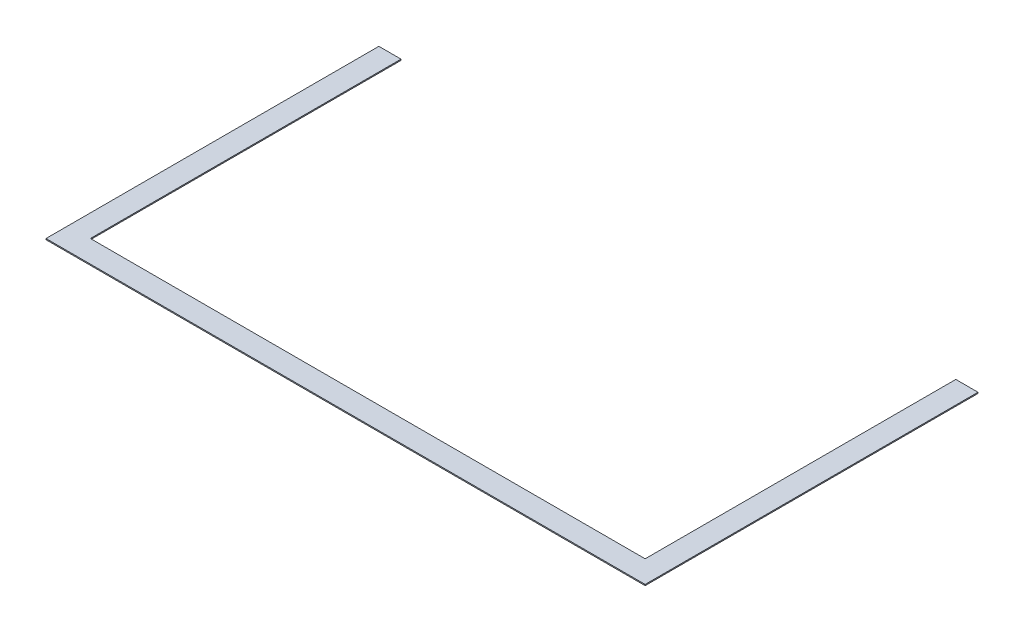
ISO-10303-21;
HEADER;
FILE_DESCRIPTION(('STEP AP214'),'2;1');
FILE_NAME('part.step','',(''),(''),'','','');
FILE_SCHEMA(('AUTOMOTIVE_DESIGN { 1 0 10303 214 1 1 1 1 }'));
ENDSEC;
DATA;
#1=APPLICATION_CONTEXT('core data for automotive mechanical design processes');
#2=APPLICATION_PROTOCOL_DEFINITION('international standard','automotive_design',2000,#1);
#3=PRODUCT_CONTEXT('',#1,'mechanical');
#4=PRODUCT('Part','Part','',(#3));
#5=PRODUCT_RELATED_PRODUCT_CATEGORY('part','',(#4));
#6=PRODUCT_DEFINITION_FORMATION('','',#4);
#7=PRODUCT_DEFINITION_CONTEXT('part definition',#1,'design');
#8=PRODUCT_DEFINITION('design','',#6,#7);
#9=PRODUCT_DEFINITION_SHAPE('','',#8);
#10=(LENGTH_UNIT() NAMED_UNIT(*) SI_UNIT(.MILLI.,.METRE.));
#11=(NAMED_UNIT(*) PLANE_ANGLE_UNIT() SI_UNIT($,.RADIAN.));
#12=(NAMED_UNIT(*) SI_UNIT($,.STERADIAN.) SOLID_ANGLE_UNIT());
#13=UNCERTAINTY_MEASURE_WITH_UNIT(LENGTH_MEASURE(1.E-05),#10,'distance_accuracy_value','');
#14=(GEOMETRIC_REPRESENTATION_CONTEXT(3) GLOBAL_UNCERTAINTY_ASSIGNED_CONTEXT((#13)) GLOBAL_UNIT_ASSIGNED_CONTEXT((#10,
#11,#12)) REPRESENTATION_CONTEXT('',''));
#15=CARTESIAN_POINT('',(0.,0.,0.));
#16=DIRECTION('',(0.,0.,1.));
#17=DIRECTION('',(1.,0.,0.));
#18=AXIS2_PLACEMENT_3D('',#15,#16,#17);
#19=CARTESIAN_POINT('',(2493.37884073959,5.,-1436.62115926041));
#20=DIRECTION('',(0.,0.,1.));
#21=DIRECTION('',(1.,0.,0.));
#22=AXIS2_PLACEMENT_3D('',#19,#20,#21);
#23=PLANE('',#22);
#24=DIRECTION('',(-1.,0.,0.));
#25=VECTOR('',#24,1.);
#26=CARTESIAN_POINT('',(2493.37884073959,0.,-1436.62115926041));
#27=LINE('',#26,#25);
#28=CARTESIAN_POINT('',(2593.37884073959,0.,-1436.62115926041));
#29=VERTEX_POINT('',#28);
#30=CARTESIAN_POINT('',(2493.37884073959,0.,-1436.62115926041));
#31=VERTEX_POINT('',#30);
#32=EDGE_CURVE('E137',#29,#31,#27,.T.);
#33=ORIENTED_EDGE('',*,*,#32,.T.);
#34=DIRECTION('',(0.,-1.,0.));
#35=VECTOR('',#34,1.);
#36=CARTESIAN_POINT('',(2493.37884073959,5.,-1436.62115926041));
#37=LINE('',#36,#35);
#38=CARTESIAN_POINT('',(2493.37884073959,5.,-1436.62115926041));
#39=VERTEX_POINT('',#38);
#40=EDGE_CURVE('E11',#39,#31,#37,.T.);
#41=ORIENTED_EDGE('',*,*,#40,.F.);
#42=DIRECTION('',(-1.,0.,0.));
#43=VECTOR('',#42,1.);
#44=CARTESIAN_POINT('',(2493.37884073959,5.,-1436.62115926041));
#45=LINE('',#44,#43);
#46=CARTESIAN_POINT('',(2593.37884073959,5.,-1436.62115926041));
#47=VERTEX_POINT('',#46);
#48=EDGE_CURVE('E151',#47,#39,#45,.T.);
#49=ORIENTED_EDGE('',*,*,#48,.F.);
#50=DIRECTION('',(0.,-1.,0.));
#51=VECTOR('',#50,1.);
#52=CARTESIAN_POINT('',(2593.37884073959,5.,-1436.62115926041));
#53=LINE('',#52,#51);
#54=EDGE_CURVE('E133',#47,#29,#53,.T.);
#55=ORIENTED_EDGE('',*,*,#54,.T.);
#56=EDGE_LOOP('',(#33,#41,#49,#55));
#57=FACE_BOUND('',#56,.T.);
#58=ADVANCED_FACE('F41',(#57),#23,.F.);
#59=CARTESIAN_POINT('',(2493.37884073959,5.,-36.6211592604097));
#60=DIRECTION('',(1.,0.,0.));
#61=DIRECTION('',(0.,0.,-1.));
#62=AXIS2_PLACEMENT_3D('',#59,#60,#61);
#63=PLANE('',#62);
#64=DIRECTION('',(0.,0.,1.));
#65=VECTOR('',#64,1.);
#66=CARTESIAN_POINT('',(2493.37884073959,0.,-36.6211592604097));
#67=LINE('',#66,#65);
#68=CARTESIAN_POINT('',(2493.37884073959,0.,-36.6211592604097));
#69=VERTEX_POINT('',#68);
#70=EDGE_CURVE('E140',#31,#69,#67,.T.);
#71=ORIENTED_EDGE('',*,*,#70,.T.);
#72=DIRECTION('',(0.,-1.,0.));
#73=VECTOR('',#72,1.);
#74=CARTESIAN_POINT('',(2493.37884073959,5.,-36.6211592604097));
#75=LINE('',#74,#73);
#76=CARTESIAN_POINT('',(2493.37884073959,5.,-36.6211592604097));
#77=VERTEX_POINT('',#76);
#78=EDGE_CURVE('E49',#77,#69,#75,.T.);
#79=ORIENTED_EDGE('',*,*,#78,.F.);
#80=DIRECTION('',(0.,0.,1.));
#81=VECTOR('',#80,1.);
#82=CARTESIAN_POINT('',(2493.37884073959,5.,-186.62115926041));
#83=LINE('',#82,#81);
#84=EDGE_CURVE('E100',#39,#77,#83,.T.);
#85=ORIENTED_EDGE('',*,*,#84,.F.);
#86=ORIENTED_EDGE('',*,*,#40,.T.);
#87=EDGE_LOOP('',(#71,#79,#85,#86));
#88=FACE_BOUND('',#87,.T.);
#89=ADVANCED_FACE('F186',(#88),#63,.F.);
#90=CARTESIAN_POINT('',(-6.62115926040992,5.,-36.6211592604097));
#91=DIRECTION('',(0.,0.,1.));
#92=DIRECTION('',(1.,0.,0.));
#93=AXIS2_PLACEMENT_3D('',#90,#91,#92);
#94=PLANE('',#93);
#95=DIRECTION('',(-1.,0.,0.));
#96=VECTOR('',#95,1.);
#97=CARTESIAN_POINT('',(-6.62115926040992,0.,-36.6211592604097));
#98=LINE('',#97,#96);
#99=CARTESIAN_POINT('',(-6.62115926040992,0.,-36.6211592604097));
#100=VERTEX_POINT('',#99);
#101=EDGE_CURVE('E142',#69,#100,#98,.T.);
#102=ORIENTED_EDGE('',*,*,#101,.T.);
#103=DIRECTION('',(0.,-1.,0.));
#104=VECTOR('',#103,1.);
#105=CARTESIAN_POINT('',(-6.62115926040992,5.,-36.6211592604097));
#106=LINE('',#105,#104);
#107=CARTESIAN_POINT('',(-6.62115926040992,5.,-36.6211592604097));
#108=VERTEX_POINT('',#107);
#109=EDGE_CURVE('E158',#108,#100,#106,.T.);
#110=ORIENTED_EDGE('',*,*,#109,.F.);
#111=DIRECTION('',(-1.,0.,0.));
#112=VECTOR('',#111,1.);
#113=CARTESIAN_POINT('',(-6.62115926040992,5.,-36.6211592604097));
#114=LINE('',#113,#112);
#115=EDGE_CURVE('E166',#77,#108,#114,.T.);
#116=ORIENTED_EDGE('',*,*,#115,.F.);
#117=ORIENTED_EDGE('',*,*,#78,.T.);
#118=EDGE_LOOP('',(#102,#110,#116,#117));
#119=FACE_BOUND('',#118,.T.);
#120=ADVANCED_FACE('F164',(#119),#94,.F.);
#121=CARTESIAN_POINT('',(-6.62115926040992,5.,-36.6211592604097));
#122=DIRECTION('',(-1.,0.,0.));
#123=DIRECTION('',(0.,0.,1.));
#124=AXIS2_PLACEMENT_3D('',#121,#122,#123);
#125=PLANE('',#124);
#126=DIRECTION('',(0.,0.,-1.));
#127=VECTOR('',#126,1.);
#128=CARTESIAN_POINT('',(-6.62115926040992,0.,-36.6211592604097));
#129=LINE('',#128,#127);
#130=CARTESIAN_POINT('',(-6.62115926040992,0.,-1436.62115926041));
#131=VERTEX_POINT('',#130);
#132=EDGE_CURVE('E144',#100,#131,#129,.T.);
#133=ORIENTED_EDGE('',*,*,#132,.T.);
#134=DIRECTION('',(0.,-1.,0.));
#135=VECTOR('',#134,1.);
#136=CARTESIAN_POINT('',(-6.62115926040992,5.,-1436.62115926041));
#137=LINE('',#136,#135);
#138=CARTESIAN_POINT('',(-6.62115926040992,5.,-1436.62115926041));
#139=VERTEX_POINT('',#138);
#140=EDGE_CURVE('E155',#139,#131,#137,.T.);
#141=ORIENTED_EDGE('',*,*,#140,.F.);
#142=DIRECTION('',(0.,0.,-1.));
#143=VECTOR('',#142,1.);
#144=CARTESIAN_POINT('',(-6.62115926040992,5.,-36.6211592604097));
#145=LINE('',#144,#143);
#146=EDGE_CURVE('E178',#108,#139,#145,.T.);
#147=ORIENTED_EDGE('',*,*,#146,.F.);
#148=ORIENTED_EDGE('',*,*,#109,.T.);
#149=EDGE_LOOP('',(#133,#141,#147,#148));
#150=FACE_BOUND('',#149,.T.);
#151=ADVANCED_FACE('F174',(#150),#125,.F.);
#152=CARTESIAN_POINT('',(-106.62115926041,5.,-1436.62115926041));
#153=DIRECTION('',(0.,0.,1.));
#154=DIRECTION('',(1.,0.,0.));
#155=AXIS2_PLACEMENT_3D('',#152,#153,#154);
#156=PLANE('',#155);
#157=DIRECTION('',(-1.,0.,0.));
#158=VECTOR('',#157,1.);
#159=CARTESIAN_POINT('',(-106.62115926041,0.,-1436.62115926041));
#160=LINE('',#159,#158);
#161=CARTESIAN_POINT('',(-106.62115926041,0.,-1436.62115926041));
#162=VERTEX_POINT('',#161);
#163=EDGE_CURVE('E146',#131,#162,#160,.T.);
#164=ORIENTED_EDGE('',*,*,#163,.T.);
#165=DIRECTION('',(0.,-1.,0.));
#166=VECTOR('',#165,1.);
#167=CARTESIAN_POINT('',(-106.62115926041,5.,-1436.62115926041));
#168=LINE('',#167,#166);
#169=CARTESIAN_POINT('',(-106.62115926041,5.,-1436.62115926041));
#170=VERTEX_POINT('',#169);
#171=EDGE_CURVE('E128',#170,#162,#168,.T.);
#172=ORIENTED_EDGE('',*,*,#171,.F.);
#173=DIRECTION('',(-1.,0.,0.));
#174=VECTOR('',#173,1.);
#175=CARTESIAN_POINT('',(-106.62115926041,5.,-1436.62115926041));
#176=LINE('',#175,#174);
#177=EDGE_CURVE('E119',#139,#170,#176,.T.);
#178=ORIENTED_EDGE('',*,*,#177,.F.);
#179=ORIENTED_EDGE('',*,*,#140,.T.);
#180=EDGE_LOOP('',(#164,#172,#178,#179));
#181=FACE_BOUND('',#180,.T.);
#182=ADVANCED_FACE('F177',(#181),#156,.F.);
#183=CARTESIAN_POINT('',(-106.62115926041,5.,63.3788407395903));
#184=DIRECTION('',(1.,0.,0.));
#185=DIRECTION('',(0.,0.,-1.));
#186=AXIS2_PLACEMENT_3D('',#183,#184,#185);
#187=PLANE('',#186);
#188=DIRECTION('',(0.,0.,1.));
#189=VECTOR('',#188,1.);
#190=CARTESIAN_POINT('',(-106.62115926041,0.,63.3788407395903));
#191=LINE('',#190,#189);
#192=CARTESIAN_POINT('',(-106.62115926041,0.,63.3788407395903));
#193=VERTEX_POINT('',#192);
#194=EDGE_CURVE('E127',#162,#193,#191,.T.);
#195=ORIENTED_EDGE('',*,*,#194,.T.);
#196=DIRECTION('',(0.,-1.,0.));
#197=VECTOR('',#196,1.);
#198=CARTESIAN_POINT('',(-106.62115926041,5.,63.3788407395903));
#199=LINE('',#198,#197);
#200=CARTESIAN_POINT('',(-106.62115926041,5.,63.3788407395903));
#201=VERTEX_POINT('',#200);
#202=EDGE_CURVE('E124',#201,#193,#199,.T.);
#203=ORIENTED_EDGE('',*,*,#202,.F.);
#204=DIRECTION('',(0.,0.,1.));
#205=VECTOR('',#204,1.);
#206=CARTESIAN_POINT('',(-106.62115926041,5.,63.3788407395903));
#207=LINE('',#206,#205);
#208=EDGE_CURVE('E113',#170,#201,#207,.T.);
#209=ORIENTED_EDGE('',*,*,#208,.F.);
#210=ORIENTED_EDGE('',*,*,#171,.T.);
#211=EDGE_LOOP('',(#195,#203,#209,#210));
#212=FACE_BOUND('',#211,.T.);
#213=ADVANCED_FACE('F125',(#212),#187,.F.);
#214=CARTESIAN_POINT('',(-106.62115926041,5.,63.3788407395903));
#215=DIRECTION('',(0.,0.,-1.));
#216=DIRECTION('',(-1.,0.,0.));
#217=AXIS2_PLACEMENT_3D('',#214,#215,#216);
#218=PLANE('',#217);
#219=DIRECTION('',(1.,0.,0.));
#220=VECTOR('',#219,1.);
#221=CARTESIAN_POINT('',(-106.62115926041,0.,63.3788407395903));
#222=LINE('',#221,#220);
#223=CARTESIAN_POINT('',(2593.37884073959,0.,63.3788407395903));
#224=VERTEX_POINT('',#223);
#225=EDGE_CURVE('E86',#193,#224,#222,.T.);
#226=ORIENTED_EDGE('',*,*,#225,.T.);
#227=DIRECTION('',(0.,-1.,0.));
#228=VECTOR('',#227,1.);
#229=CARTESIAN_POINT('',(2593.37884073959,5.,63.3788407395903));
#230=LINE('',#229,#228);
#231=CARTESIAN_POINT('',(2593.37884073959,5.,63.3788407395903));
#232=VERTEX_POINT('',#231);
#233=EDGE_CURVE('E129',#232,#224,#230,.T.);
#234=ORIENTED_EDGE('',*,*,#233,.F.);
#235=DIRECTION('',(1.,0.,0.));
#236=VECTOR('',#235,1.);
#237=CARTESIAN_POINT('',(-106.62115926041,5.,63.3788407395903));
#238=LINE('',#237,#236);
#239=EDGE_CURVE('E117',#201,#232,#238,.T.);
#240=ORIENTED_EDGE('',*,*,#239,.F.);
#241=ORIENTED_EDGE('',*,*,#202,.T.);
#242=EDGE_LOOP('',(#226,#234,#240,#241));
#243=FACE_BOUND('',#242,.T.);
#244=ADVANCED_FACE('F131',(#243),#218,.F.);
#245=CARTESIAN_POINT('',(2593.37884073959,5.,63.3788407395903));
#246=DIRECTION('',(-1.,0.,0.));
#247=DIRECTION('',(0.,0.,1.));
#248=AXIS2_PLACEMENT_3D('',#245,#246,#247);
#249=PLANE('',#248);
#250=DIRECTION('',(0.,0.,-1.));
#251=VECTOR('',#250,1.);
#252=CARTESIAN_POINT('',(2593.37884073959,0.,63.3788407395903));
#253=LINE('',#252,#251);
#254=EDGE_CURVE('E92',#224,#29,#253,.T.);
#255=ORIENTED_EDGE('',*,*,#254,.T.);
#256=ORIENTED_EDGE('',*,*,#54,.F.);
#257=DIRECTION('',(0.,0.,-1.));
#258=VECTOR('',#257,1.);
#259=CARTESIAN_POINT('',(2593.37884073959,5.,63.3788407395903));
#260=LINE('',#259,#258);
#261=EDGE_CURVE('E57',#232,#47,#260,.T.);
#262=ORIENTED_EDGE('',*,*,#261,.F.);
#263=ORIENTED_EDGE('',*,*,#233,.T.);
#264=EDGE_LOOP('',(#255,#256,#262,#263));
#265=FACE_BOUND('',#264,.T.);
#266=ADVANCED_FACE('F202',(#265),#249,.F.);
#267=CARTESIAN_POINT('',(0.,5.,0.));
#268=DIRECTION('',(0.,1.,0.));
#269=DIRECTION('',(0.,0.,1.));
#270=AXIS2_PLACEMENT_3D('',#267,#268,#269);
#271=PLANE('',#270);
#272=ORIENTED_EDGE('',*,*,#48,.T.);
#273=ORIENTED_EDGE('',*,*,#84,.T.);
#274=ORIENTED_EDGE('',*,*,#115,.T.);
#275=ORIENTED_EDGE('',*,*,#146,.T.);
#276=ORIENTED_EDGE('',*,*,#177,.T.);
#277=ORIENTED_EDGE('',*,*,#208,.T.);
#278=ORIENTED_EDGE('',*,*,#239,.T.);
#279=ORIENTED_EDGE('',*,*,#261,.T.);
#280=EDGE_LOOP('',(#272,#273,#274,#275,#276,#277,#278,#279));
#281=FACE_BOUND('',#280,.T.);
#282=ADVANCED_FACE('F115',(#281),#271,.T.);
#283=CARTESIAN_POINT('',(0.,0.,0.));
#284=DIRECTION('',(0.,1.,0.));
#285=DIRECTION('',(0.,0.,1.));
#286=AXIS2_PLACEMENT_3D('',#283,#284,#285);
#287=PLANE('',#286);
#288=ORIENTED_EDGE('',*,*,#32,.F.);
#289=ORIENTED_EDGE('',*,*,#254,.F.);
#290=ORIENTED_EDGE('',*,*,#225,.F.);
#291=ORIENTED_EDGE('',*,*,#194,.F.);
#292=ORIENTED_EDGE('',*,*,#163,.F.);
#293=ORIENTED_EDGE('',*,*,#132,.F.);
#294=ORIENTED_EDGE('',*,*,#101,.F.);
#295=ORIENTED_EDGE('',*,*,#70,.F.);
#296=EDGE_LOOP('',(#288,#289,#290,#291,#292,#293,#294,#295));
#297=FACE_BOUND('',#296,.T.);
#298=ADVANCED_FACE('F170',(#297),#287,.F.);
#299=CLOSED_SHELL('',(#58,#89,#120,#151,#182,#213,#244,#266,#282,#298));
#300=MANIFOLD_SOLID_BREP('B2',#299);
#301=ADVANCED_BREP_SHAPE_REPRESENTATION('',(#18,#300),#14);
#302=SHAPE_DEFINITION_REPRESENTATION(#9,#301);
ENDSEC;
END-ISO-10303-21;
